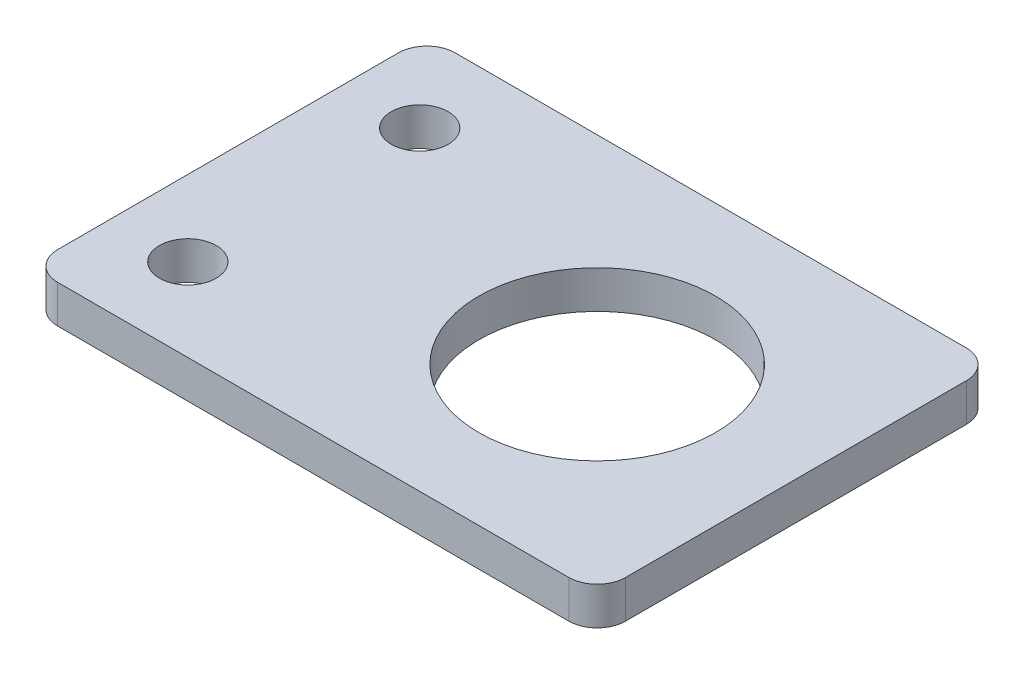
ISO-10303-21;
HEADER;
FILE_DESCRIPTION(('STEP AP214'),'2;1');
FILE_NAME('part.step','',(''),(''),'','','');
FILE_SCHEMA(('AUTOMOTIVE_DESIGN { 1 0 10303 214 1 1 1 1 }'));
ENDSEC;
DATA;
#1=APPLICATION_CONTEXT('core data for automotive mechanical design processes');
#2=APPLICATION_PROTOCOL_DEFINITION('international standard','automotive_design',2000,#1);
#3=PRODUCT_CONTEXT('',#1,'mechanical');
#4=PRODUCT('Part','Part','',(#3));
#5=PRODUCT_RELATED_PRODUCT_CATEGORY('part','',(#4));
#6=PRODUCT_DEFINITION_FORMATION('','',#4);
#7=PRODUCT_DEFINITION_CONTEXT('part definition',#1,'design');
#8=PRODUCT_DEFINITION('design','',#6,#7);
#9=PRODUCT_DEFINITION_SHAPE('','',#8);
#10=(LENGTH_UNIT() NAMED_UNIT(*) SI_UNIT(.MILLI.,.METRE.));
#11=(NAMED_UNIT(*) PLANE_ANGLE_UNIT() SI_UNIT($,.RADIAN.));
#12=(NAMED_UNIT(*) SI_UNIT($,.STERADIAN.) SOLID_ANGLE_UNIT());
#13=UNCERTAINTY_MEASURE_WITH_UNIT(LENGTH_MEASURE(1.E-05),#10,'distance_accuracy_value','');
#14=(GEOMETRIC_REPRESENTATION_CONTEXT(3) GLOBAL_UNCERTAINTY_ASSIGNED_CONTEXT((#13)) GLOBAL_UNIT_ASSIGNED_CONTEXT((#10,
#11,#12)) REPRESENTATION_CONTEXT('',''));
#15=CARTESIAN_POINT('',(0.,0.,0.));
#16=DIRECTION('',(0.,0.,1.));
#17=DIRECTION('',(1.,0.,0.));
#18=AXIS2_PLACEMENT_3D('',#15,#16,#17);
#19=CARTESIAN_POINT('',(0.,4.,0.));
#20=DIRECTION('',(0.,1.,0.));
#21=DIRECTION('',(0.,0.,1.));
#22=AXIS2_PLACEMENT_3D('',#19,#20,#21);
#23=PLANE('',#22);
#24=CARTESIAN_POINT('',(-22.,4.,-12.25));
#25=DIRECTION('',(0.,1.,0.));
#26=DIRECTION('',(0.,0.,1.));
#27=AXIS2_PLACEMENT_3D('',#24,#25,#26);
#28=CIRCLE('',#27,3.);
#29=CARTESIAN_POINT('',(-22.,4.,-9.25000000000001));
#30=VERTEX_POINT('',#29);
#31=EDGE_CURVE('E202',#30,#30,#28,.T.);
#32=ORIENTED_EDGE('',*,*,#31,.F.);
#33=EDGE_LOOP('',(#32));
#34=FACE_BOUND('',#33,.T.);
#35=DIRECTION('',(0.,0.,1.));
#36=VECTOR('',#35,1.);
#37=CARTESIAN_POINT('',(-30.,4.,-21.));
#38=LINE('',#37,#36);
#39=CARTESIAN_POINT('',(-30.,4.,-18.));
#40=VERTEX_POINT('',#39);
#41=CARTESIAN_POINT('',(-30.,4.,18.));
#42=VERTEX_POINT('',#41);
#43=EDGE_CURVE('E192',#40,#42,#38,.T.);
#44=ORIENTED_EDGE('',*,*,#43,.T.);
#45=CARTESIAN_POINT('',(-27.,4.,18.));
#46=DIRECTION('',(0.,1.,0.));
#47=DIRECTION('',(0.,0.,1.));
#48=AXIS2_PLACEMENT_3D('',#45,#46,#47);
#49=CIRCLE('',#48,3.);
#50=CARTESIAN_POINT('',(-27.,4.,21.));
#51=VERTEX_POINT('',#50);
#52=EDGE_CURVE('E168',#42,#51,#49,.T.);
#53=ORIENTED_EDGE('',*,*,#52,.T.);
#54=DIRECTION('',(1.,0.,0.));
#55=VECTOR('',#54,1.);
#56=CARTESIAN_POINT('',(-30.,4.,21.));
#57=LINE('',#56,#55);
#58=CARTESIAN_POINT('',(27.,4.,21.));
#59=VERTEX_POINT('',#58);
#60=EDGE_CURVE('E126',#51,#59,#57,.T.);
#61=ORIENTED_EDGE('',*,*,#60,.T.);
#62=CARTESIAN_POINT('',(27.,4.,18.));
#63=DIRECTION('',(0.,1.,0.));
#64=DIRECTION('',(0.,0.,1.));
#65=AXIS2_PLACEMENT_3D('',#62,#63,#64);
#66=CIRCLE('',#65,3.);
#67=CARTESIAN_POINT('',(30.,4.,18.));
#68=VERTEX_POINT('',#67);
#69=EDGE_CURVE('E165',#59,#68,#66,.T.);
#70=ORIENTED_EDGE('',*,*,#69,.T.);
#71=DIRECTION('',(0.,0.,-1.));
#72=VECTOR('',#71,1.);
#73=CARTESIAN_POINT('',(30.,4.,-21.));
#74=LINE('',#73,#72);
#75=CARTESIAN_POINT('',(30.,4.,-18.));
#76=VERTEX_POINT('',#75);
#77=EDGE_CURVE('E135',#68,#76,#74,.T.);
#78=ORIENTED_EDGE('',*,*,#77,.T.);
#79=CARTESIAN_POINT('',(27.,4.,-18.));
#80=DIRECTION('',(0.,1.,0.));
#81=DIRECTION('',(0.,0.,1.));
#82=AXIS2_PLACEMENT_3D('',#79,#80,#81);
#83=CIRCLE('',#82,3.);
#84=CARTESIAN_POINT('',(27.,4.,-21.));
#85=VERTEX_POINT('',#84);
#86=EDGE_CURVE('E60',#76,#85,#83,.T.);
#87=ORIENTED_EDGE('',*,*,#86,.T.);
#88=DIRECTION('',(-1.,0.,0.));
#89=VECTOR('',#88,1.);
#90=CARTESIAN_POINT('',(-30.,4.,-21.));
#91=LINE('',#90,#89);
#92=CARTESIAN_POINT('',(-27.,4.,-21.));
#93=VERTEX_POINT('',#92);
#94=EDGE_CURVE('E140',#85,#93,#91,.T.);
#95=ORIENTED_EDGE('',*,*,#94,.T.);
#96=CARTESIAN_POINT('',(-27.,4.,-18.));
#97=DIRECTION('',(0.,1.,0.));
#98=DIRECTION('',(0.,0.,1.));
#99=AXIS2_PLACEMENT_3D('',#96,#97,#98);
#100=CIRCLE('',#99,3.);
#101=EDGE_CURVE('E162',#93,#40,#100,.T.);
#102=ORIENTED_EDGE('',*,*,#101,.T.);
#103=EDGE_LOOP('',(#44,#53,#61,#70,#78,#87,#95,#102));
#104=FACE_BOUND('',#103,.T.);
#105=CARTESIAN_POINT('',(9.00000000000001,4.,0.));
#106=DIRECTION('',(0.,1.,0.));
#107=DIRECTION('',(0.,0.,1.));
#108=AXIS2_PLACEMENT_3D('',#105,#106,#107);
#109=CIRCLE('',#108,12.5);
#110=CARTESIAN_POINT('',(9.00000000000001,4.,12.5));
#111=VERTEX_POINT('',#110);
#112=EDGE_CURVE('E187',#111,#111,#109,.T.);
#113=ORIENTED_EDGE('',*,*,#112,.F.);
#114=EDGE_LOOP('',(#113));
#115=FACE_BOUND('',#114,.T.);
#116=CARTESIAN_POINT('',(-22.,4.,12.25));
#117=DIRECTION('',(0.,1.,0.));
#118=DIRECTION('',(0.,0.,1.));
#119=AXIS2_PLACEMENT_3D('',#116,#117,#118);
#120=CIRCLE('',#119,3.);
#121=CARTESIAN_POINT('',(-22.,4.,15.25));
#122=VERTEX_POINT('',#121);
#123=EDGE_CURVE('E210',#122,#122,#120,.T.);
#124=ORIENTED_EDGE('',*,*,#123,.F.);
#125=EDGE_LOOP('',(#124));
#126=FACE_BOUND('',#125,.T.);
#127=ADVANCED_FACE('F39',(#34,#104,#115,#126),#23,.T.);
#128=CARTESIAN_POINT('',(0.,0.,0.));
#129=DIRECTION('',(0.,1.,0.));
#130=DIRECTION('',(0.,0.,1.));
#131=AXIS2_PLACEMENT_3D('',#128,#129,#130);
#132=PLANE('',#131);
#133=DIRECTION('',(1.,0.,0.));
#134=VECTOR('',#133,1.);
#135=CARTESIAN_POINT('',(-30.,0.,21.));
#136=LINE('',#135,#134);
#137=CARTESIAN_POINT('',(-27.,0.,21.));
#138=VERTEX_POINT('',#137);
#139=CARTESIAN_POINT('',(27.,0.,21.));
#140=VERTEX_POINT('',#139);
#141=EDGE_CURVE('E123',#138,#140,#136,.T.);
#142=ORIENTED_EDGE('',*,*,#141,.F.);
#143=CARTESIAN_POINT('',(-27.,0.,18.));
#144=DIRECTION('',(0.,1.,0.));
#145=DIRECTION('',(0.,0.,1.));
#146=AXIS2_PLACEMENT_3D('',#143,#144,#145);
#147=CIRCLE('',#146,3.);
#148=CARTESIAN_POINT('',(-30.,0.,18.));
#149=VERTEX_POINT('',#148);
#150=EDGE_CURVE('E105',#138,#149,#147,.F.);
#151=ORIENTED_EDGE('',*,*,#150,.T.);
#152=DIRECTION('',(0.,0.,1.));
#153=VECTOR('',#152,1.);
#154=CARTESIAN_POINT('',(-30.,0.,-21.));
#155=LINE('',#154,#153);
#156=CARTESIAN_POINT('',(-30.,0.,-18.));
#157=VERTEX_POINT('',#156);
#158=EDGE_CURVE('E136',#157,#149,#155,.T.);
#159=ORIENTED_EDGE('',*,*,#158,.F.);
#160=CARTESIAN_POINT('',(-27.,0.,-18.));
#161=DIRECTION('',(0.,1.,0.));
#162=DIRECTION('',(0.,0.,1.));
#163=AXIS2_PLACEMENT_3D('',#160,#161,#162);
#164=CIRCLE('',#163,3.);
#165=CARTESIAN_POINT('',(-27.,0.,-21.));
#166=VERTEX_POINT('',#165);
#167=EDGE_CURVE('E150',#157,#166,#164,.F.);
#168=ORIENTED_EDGE('',*,*,#167,.T.);
#169=DIRECTION('',(-1.,0.,0.));
#170=VECTOR('',#169,1.);
#171=CARTESIAN_POINT('',(-30.,0.,-21.));
#172=LINE('',#171,#170);
#173=CARTESIAN_POINT('',(27.,0.,-21.));
#174=VERTEX_POINT('',#173);
#175=EDGE_CURVE('E142',#174,#166,#172,.T.);
#176=ORIENTED_EDGE('',*,*,#175,.F.);
#177=CARTESIAN_POINT('',(27.,0.,-18.));
#178=DIRECTION('',(0.,1.,0.));
#179=DIRECTION('',(0.,0.,1.));
#180=AXIS2_PLACEMENT_3D('',#177,#178,#179);
#181=CIRCLE('',#180,3.);
#182=CARTESIAN_POINT('',(30.,0.,-18.));
#183=VERTEX_POINT('',#182);
#184=EDGE_CURVE('E128',#174,#183,#181,.F.);
#185=ORIENTED_EDGE('',*,*,#184,.T.);
#186=DIRECTION('',(0.,0.,-1.));
#187=VECTOR('',#186,1.);
#188=CARTESIAN_POINT('',(30.,0.,-21.));
#189=LINE('',#188,#187);
#190=CARTESIAN_POINT('',(30.,0.,18.));
#191=VERTEX_POINT('',#190);
#192=EDGE_CURVE('E185',#191,#183,#189,.T.);
#193=ORIENTED_EDGE('',*,*,#192,.F.);
#194=CARTESIAN_POINT('',(27.,0.,18.));
#195=DIRECTION('',(0.,1.,0.));
#196=DIRECTION('',(0.,0.,1.));
#197=AXIS2_PLACEMENT_3D('',#194,#195,#196);
#198=CIRCLE('',#197,3.);
#199=EDGE_CURVE('E117',#191,#140,#198,.F.);
#200=ORIENTED_EDGE('',*,*,#199,.T.);
#201=EDGE_LOOP('',(#142,#151,#159,#168,#176,#185,#193,#200));
#202=FACE_BOUND('',#201,.T.);
#203=CARTESIAN_POINT('',(9.00000000000001,0.,0.));
#204=DIRECTION('',(0.,1.,0.));
#205=DIRECTION('',(0.,0.,1.));
#206=AXIS2_PLACEMENT_3D('',#203,#204,#205);
#207=CIRCLE('',#206,12.5);
#208=CARTESIAN_POINT('',(9.00000000000001,0.,12.5));
#209=VERTEX_POINT('',#208);
#210=EDGE_CURVE('E198',#209,#209,#207,.T.);
#211=ORIENTED_EDGE('',*,*,#210,.T.);
#212=EDGE_LOOP('',(#211));
#213=FACE_BOUND('',#212,.T.);
#214=CARTESIAN_POINT('',(-22.,0.,-12.25));
#215=DIRECTION('',(0.,1.,0.));
#216=DIRECTION('',(0.,0.,1.));
#217=AXIS2_PLACEMENT_3D('',#214,#215,#216);
#218=CIRCLE('',#217,3.);
#219=CARTESIAN_POINT('',(-22.,0.,-9.25000000000001));
#220=VERTEX_POINT('',#219);
#221=EDGE_CURVE('E206',#220,#220,#218,.T.);
#222=ORIENTED_EDGE('',*,*,#221,.T.);
#223=EDGE_LOOP('',(#222));
#224=FACE_BOUND('',#223,.T.);
#225=CARTESIAN_POINT('',(-22.,0.,12.25));
#226=DIRECTION('',(0.,1.,0.));
#227=DIRECTION('',(0.,0.,1.));
#228=AXIS2_PLACEMENT_3D('',#225,#226,#227);
#229=CIRCLE('',#228,3.);
#230=CARTESIAN_POINT('',(-22.,0.,15.25));
#231=VERTEX_POINT('',#230);
#232=EDGE_CURVE('E214',#231,#231,#229,.T.);
#233=ORIENTED_EDGE('',*,*,#232,.T.);
#234=EDGE_LOOP('',(#233));
#235=FACE_BOUND('',#234,.T.);
#236=ADVANCED_FACE('F131',(#202,#213,#224,#235),#132,.F.);
#237=CARTESIAN_POINT('',(30.,4.,-21.));
#238=DIRECTION('',(-1.,0.,0.));
#239=DIRECTION('',(0.,0.,1.));
#240=AXIS2_PLACEMENT_3D('',#237,#238,#239);
#241=PLANE('',#240);
#242=ORIENTED_EDGE('',*,*,#77,.F.);
#243=DIRECTION('',(0.,-1.,0.));
#244=VECTOR('',#243,1.);
#245=CARTESIAN_POINT('',(30.,4.,18.));
#246=LINE('',#245,#244);
#247=EDGE_CURVE('E174',#68,#191,#246,.T.);
#248=ORIENTED_EDGE('',*,*,#247,.T.);
#249=ORIENTED_EDGE('',*,*,#192,.T.);
#250=DIRECTION('',(0.,-1.,0.));
#251=VECTOR('',#250,1.);
#252=CARTESIAN_POINT('',(30.,4.,-18.));
#253=LINE('',#252,#251);
#254=EDGE_CURVE('E171',#183,#76,#253,.F.);
#255=ORIENTED_EDGE('',*,*,#254,.T.);
#256=EDGE_LOOP('',(#242,#248,#249,#255));
#257=FACE_BOUND('',#256,.T.);
#258=ADVANCED_FACE('F231',(#257),#241,.F.);
#259=CARTESIAN_POINT('',(-30.,4.,-21.));
#260=DIRECTION('',(0.,0.,1.));
#261=DIRECTION('',(1.,0.,0.));
#262=AXIS2_PLACEMENT_3D('',#259,#260,#261);
#263=PLANE('',#262);
#264=ORIENTED_EDGE('',*,*,#175,.T.);
#265=DIRECTION('',(0.,-1.,0.));
#266=VECTOR('',#265,1.);
#267=CARTESIAN_POINT('',(-27.,4.,-21.));
#268=LINE('',#267,#266);
#269=EDGE_CURVE('E11',#166,#93,#268,.F.);
#270=ORIENTED_EDGE('',*,*,#269,.T.);
#271=ORIENTED_EDGE('',*,*,#94,.F.);
#272=DIRECTION('',(0.,-1.,0.));
#273=VECTOR('',#272,1.);
#274=CARTESIAN_POINT('',(27.,4.,-21.));
#275=LINE('',#274,#273);
#276=EDGE_CURVE('E48',#85,#174,#275,.T.);
#277=ORIENTED_EDGE('',*,*,#276,.T.);
#278=EDGE_LOOP('',(#264,#270,#271,#277));
#279=FACE_BOUND('',#278,.T.);
#280=ADVANCED_FACE('F181',(#279),#263,.F.);
#281=CARTESIAN_POINT('',(-30.,4.,-21.));
#282=DIRECTION('',(1.,0.,0.));
#283=DIRECTION('',(0.,0.,-1.));
#284=AXIS2_PLACEMENT_3D('',#281,#282,#283);
#285=PLANE('',#284);
#286=ORIENTED_EDGE('',*,*,#158,.T.);
#287=DIRECTION('',(0.,-1.,0.));
#288=VECTOR('',#287,1.);
#289=CARTESIAN_POINT('',(-30.,4.,18.));
#290=LINE('',#289,#288);
#291=EDGE_CURVE('E110',#149,#42,#290,.F.);
#292=ORIENTED_EDGE('',*,*,#291,.T.);
#293=ORIENTED_EDGE('',*,*,#43,.F.);
#294=DIRECTION('',(0.,-1.,0.));
#295=VECTOR('',#294,1.);
#296=CARTESIAN_POINT('',(-30.,4.,-18.));
#297=LINE('',#296,#295);
#298=EDGE_CURVE('E116',#40,#157,#297,.T.);
#299=ORIENTED_EDGE('',*,*,#298,.T.);
#300=EDGE_LOOP('',(#286,#292,#293,#299));
#301=FACE_BOUND('',#300,.T.);
#302=ADVANCED_FACE('F240',(#301),#285,.F.);
#303=CARTESIAN_POINT('',(-30.,4.,21.));
#304=DIRECTION('',(0.,0.,-1.));
#305=DIRECTION('',(-1.,0.,0.));
#306=AXIS2_PLACEMENT_3D('',#303,#304,#305);
#307=PLANE('',#306);
#308=ORIENTED_EDGE('',*,*,#60,.F.);
#309=DIRECTION('',(0.,-1.,0.));
#310=VECTOR('',#309,1.);
#311=CARTESIAN_POINT('',(-27.,4.,21.));
#312=LINE('',#311,#310);
#313=EDGE_CURVE('E109',#51,#138,#312,.T.);
#314=ORIENTED_EDGE('',*,*,#313,.T.);
#315=ORIENTED_EDGE('',*,*,#141,.T.);
#316=DIRECTION('',(0.,-1.,0.));
#317=VECTOR('',#316,1.);
#318=CARTESIAN_POINT('',(27.,4.,21.));
#319=LINE('',#318,#317);
#320=EDGE_CURVE('E129',#140,#59,#319,.F.);
#321=ORIENTED_EDGE('',*,*,#320,.T.);
#322=EDGE_LOOP('',(#308,#314,#315,#321));
#323=FACE_BOUND('',#322,.T.);
#324=ADVANCED_FACE('F122',(#323),#307,.F.);
#325=CARTESIAN_POINT('',(9.00000000000001,4.,0.));
#326=DIRECTION('',(0.,-1.,0.));
#327=DIRECTION('',(0.,0.,-1.));
#328=AXIS2_PLACEMENT_3D('',#325,#326,#327);
#329=CYLINDRICAL_SURFACE('',#328,12.5);
#330=ORIENTED_EDGE('',*,*,#112,.T.);
#331=EDGE_LOOP('',(#330));
#332=FACE_BOUND('',#331,.T.);
#333=ORIENTED_EDGE('',*,*,#210,.F.);
#334=EDGE_LOOP('',(#333));
#335=FACE_BOUND('',#334,.T.);
#336=ADVANCED_FACE('F235',(#332,#335),#329,.F.);
#337=CARTESIAN_POINT('',(-22.,4.,-12.25));
#338=DIRECTION('',(0.,-1.,0.));
#339=DIRECTION('',(0.,0.,-1.));
#340=AXIS2_PLACEMENT_3D('',#337,#338,#339);
#341=CYLINDRICAL_SURFACE('',#340,3.);
#342=ORIENTED_EDGE('',*,*,#31,.T.);
#343=EDGE_LOOP('',(#342));
#344=FACE_BOUND('',#343,.T.);
#345=ORIENTED_EDGE('',*,*,#221,.F.);
#346=EDGE_LOOP('',(#345));
#347=FACE_BOUND('',#346,.T.);
#348=ADVANCED_FACE('F272',(#344,#347),#341,.F.);
#349=CARTESIAN_POINT('',(-22.,4.,12.25));
#350=DIRECTION('',(0.,-1.,0.));
#351=DIRECTION('',(0.,0.,-1.));
#352=AXIS2_PLACEMENT_3D('',#349,#350,#351);
#353=CYLINDRICAL_SURFACE('',#352,3.);
#354=ORIENTED_EDGE('',*,*,#123,.T.);
#355=EDGE_LOOP('',(#354));
#356=FACE_BOUND('',#355,.T.);
#357=ORIENTED_EDGE('',*,*,#232,.F.);
#358=EDGE_LOOP('',(#357));
#359=FACE_BOUND('',#358,.T.);
#360=ADVANCED_FACE('F222',(#356,#359),#353,.F.);
#361=CARTESIAN_POINT('',(-27.,4.,18.));
#362=DIRECTION('',(0.,-1.,0.));
#363=DIRECTION('',(0.,0.,-1.));
#364=AXIS2_PLACEMENT_3D('',#361,#362,#363);
#365=CYLINDRICAL_SURFACE('',#364,3.);
#366=ORIENTED_EDGE('',*,*,#52,.F.);
#367=ORIENTED_EDGE('',*,*,#291,.F.);
#368=ORIENTED_EDGE('',*,*,#150,.F.);
#369=ORIENTED_EDGE('',*,*,#313,.F.);
#370=EDGE_LOOP('',(#366,#367,#368,#369));
#371=FACE_BOUND('',#370,.T.);
#372=ADVANCED_FACE('F108',(#371),#365,.T.);
#373=CARTESIAN_POINT('',(27.,4.,18.));
#374=DIRECTION('',(0.,-1.,0.));
#375=DIRECTION('',(0.,0.,-1.));
#376=AXIS2_PLACEMENT_3D('',#373,#374,#375);
#377=CYLINDRICAL_SURFACE('',#376,3.);
#378=ORIENTED_EDGE('',*,*,#69,.F.);
#379=ORIENTED_EDGE('',*,*,#320,.F.);
#380=ORIENTED_EDGE('',*,*,#199,.F.);
#381=ORIENTED_EDGE('',*,*,#247,.F.);
#382=EDGE_LOOP('',(#378,#379,#380,#381));
#383=FACE_BOUND('',#382,.T.);
#384=ADVANCED_FACE('F251',(#383),#377,.T.);
#385=CARTESIAN_POINT('',(-27.,4.,-18.));
#386=DIRECTION('',(0.,-1.,0.));
#387=DIRECTION('',(0.,0.,-1.));
#388=AXIS2_PLACEMENT_3D('',#385,#386,#387);
#389=CYLINDRICAL_SURFACE('',#388,3.);
#390=ORIENTED_EDGE('',*,*,#101,.F.);
#391=ORIENTED_EDGE('',*,*,#269,.F.);
#392=ORIENTED_EDGE('',*,*,#167,.F.);
#393=ORIENTED_EDGE('',*,*,#298,.F.);
#394=EDGE_LOOP('',(#390,#391,#392,#393));
#395=FACE_BOUND('',#394,.T.);
#396=ADVANCED_FACE('F253',(#395),#389,.T.);
#397=CARTESIAN_POINT('',(27.,4.,-18.));
#398=DIRECTION('',(0.,-1.,0.));
#399=DIRECTION('',(0.,0.,-1.));
#400=AXIS2_PLACEMENT_3D('',#397,#398,#399);
#401=CYLINDRICAL_SURFACE('',#400,3.);
#402=ORIENTED_EDGE('',*,*,#86,.F.);
#403=ORIENTED_EDGE('',*,*,#254,.F.);
#404=ORIENTED_EDGE('',*,*,#184,.F.);
#405=ORIENTED_EDGE('',*,*,#276,.F.);
#406=EDGE_LOOP('',(#402,#403,#404,#405));
#407=FACE_BOUND('',#406,.T.);
#408=ADVANCED_FACE('F41',(#407),#401,.T.);
#409=CLOSED_SHELL('',(#127,#236,#258,#280,#302,#324,#336,#348,#360,#372,#384,#396,#408));
#410=MANIFOLD_SOLID_BREP('B2',#409);
#411=ADVANCED_BREP_SHAPE_REPRESENTATION('',(#18,#410),#14);
#412=SHAPE_DEFINITION_REPRESENTATION(#9,#411);
ENDSEC;
END-ISO-10303-21;
